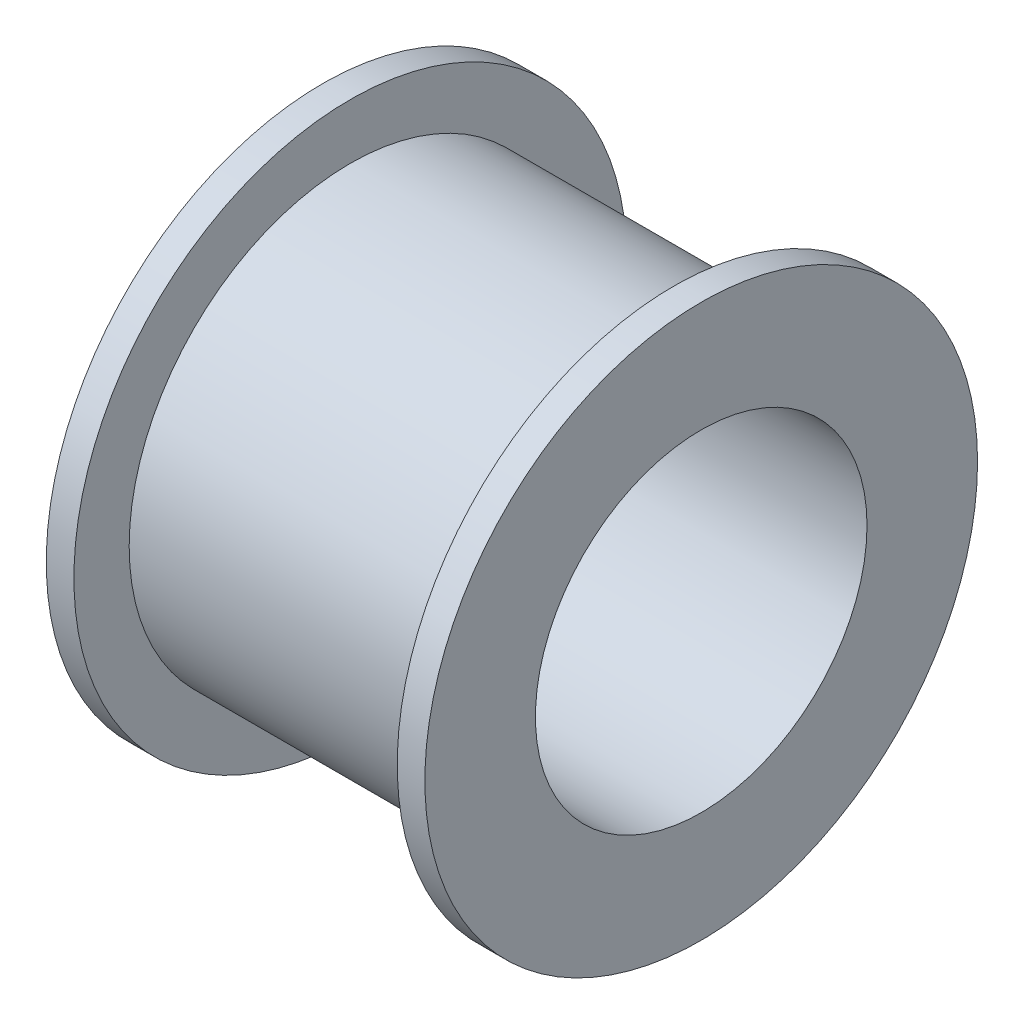
ISO-10303-21;
HEADER;
FILE_DESCRIPTION(('STEP AP214'),'2;1');
FILE_NAME('part.step','',(''),(''),'','','');
FILE_SCHEMA(('AUTOMOTIVE_DESIGN { 1 0 10303 214 1 1 1 1 }'));
ENDSEC;
DATA;
#1=APPLICATION_CONTEXT('core data for automotive mechanical design processes');
#2=APPLICATION_PROTOCOL_DEFINITION('international standard','automotive_design',2000,#1);
#3=PRODUCT_CONTEXT('',#1,'mechanical');
#4=PRODUCT('Part','Part','',(#3));
#5=PRODUCT_RELATED_PRODUCT_CATEGORY('part','',(#4));
#6=PRODUCT_DEFINITION_FORMATION('','',#4);
#7=PRODUCT_DEFINITION_CONTEXT('part definition',#1,'design');
#8=PRODUCT_DEFINITION('design','',#6,#7);
#9=PRODUCT_DEFINITION_SHAPE('','',#8);
#10=(LENGTH_UNIT() NAMED_UNIT(*) SI_UNIT(.MILLI.,.METRE.));
#11=(NAMED_UNIT(*) PLANE_ANGLE_UNIT() SI_UNIT($,.RADIAN.));
#12=(NAMED_UNIT(*) SI_UNIT($,.STERADIAN.) SOLID_ANGLE_UNIT());
#13=UNCERTAINTY_MEASURE_WITH_UNIT(LENGTH_MEASURE(1.E-05),#10,'distance_accuracy_value','');
#14=(GEOMETRIC_REPRESENTATION_CONTEXT(3) GLOBAL_UNCERTAINTY_ASSIGNED_CONTEXT((#13)) GLOBAL_UNIT_ASSIGNED_CONTEXT((#10,
#11,#12)) REPRESENTATION_CONTEXT('',''));
#15=CARTESIAN_POINT('',(0.,0.,0.));
#16=DIRECTION('',(0.,0.,1.));
#17=DIRECTION('',(1.,0.,0.));
#18=AXIS2_PLACEMENT_3D('',#15,#16,#17);
#19=CARTESIAN_POINT('',(71.925,0.,0.));
#20=DIRECTION('',(1.,0.,0.));
#21=DIRECTION('',(0.,0.,-1.));
#22=AXIS2_PLACEMENT_3D('',#19,#20,#21);
#23=CYLINDRICAL_SURFACE('',#22,100.);
#24=CARTESIAN_POINT('',(0.,0.,0.));
#25=DIRECTION('',(1.,0.,0.));
#26=DIRECTION('',(0.,0.,-1.));
#27=AXIS2_PLACEMENT_3D('',#24,#25,#26);
#28=CIRCLE('',#27,100.);
#29=CARTESIAN_POINT('',(0.,0.,-100.));
#30=VERTEX_POINT('',#29);
#31=EDGE_CURVE('E45',#30,#30,#28,.T.);
#32=ORIENTED_EDGE('',*,*,#31,.T.);
#33=EDGE_LOOP('',(#32));
#34=FACE_BOUND('',#33,.T.);
#35=CARTESIAN_POINT('',(9.99999999999999,0.,0.));
#36=DIRECTION('',(1.,0.,0.));
#37=DIRECTION('',(0.,0.,-1.));
#38=AXIS2_PLACEMENT_3D('',#35,#36,#37);
#39=CIRCLE('',#38,100.);
#40=CARTESIAN_POINT('',(9.99999999999999,0.,-100.));
#41=VERTEX_POINT('',#40);
#42=EDGE_CURVE('E10',#41,#41,#39,.T.);
#43=ORIENTED_EDGE('',*,*,#42,.F.);
#44=EDGE_LOOP('',(#43));
#45=FACE_BOUND('',#44,.T.);
#46=ADVANCED_FACE('F31',(#34,#45),#23,.T.);
#47=CARTESIAN_POINT('',(10.,100.,0.));
#48=DIRECTION('',(1.,0.,0.));
#49=DIRECTION('',(0.,0.,-1.));
#50=AXIS2_PLACEMENT_3D('',#47,#48,#49);
#51=PLANE('',#50);
#52=ORIENTED_EDGE('',*,*,#42,.T.);
#53=EDGE_LOOP('',(#52));
#54=FACE_BOUND('',#53,.T.);
#55=CARTESIAN_POINT('',(10.,0.,0.));
#56=DIRECTION('',(1.,0.,0.));
#57=DIRECTION('',(0.,0.,-1.));
#58=AXIS2_PLACEMENT_3D('',#55,#56,#57);
#59=CIRCLE('',#58,80.);
#60=CARTESIAN_POINT('',(10.,0.,-80.));
#61=VERTEX_POINT('',#60);
#62=EDGE_CURVE('E37',#61,#61,#59,.T.);
#63=ORIENTED_EDGE('',*,*,#62,.F.);
#64=EDGE_LOOP('',(#63));
#65=FACE_BOUND('',#64,.T.);
#66=ADVANCED_FACE('F81',(#54,#65),#51,.T.);
#67=CARTESIAN_POINT('',(71.925,0.,0.));
#68=DIRECTION('',(1.,0.,0.));
#69=DIRECTION('',(0.,0.,-1.));
#70=AXIS2_PLACEMENT_3D('',#67,#68,#69);
#71=CYLINDRICAL_SURFACE('',#70,80.);
#72=ORIENTED_EDGE('',*,*,#62,.T.);
#73=EDGE_LOOP('',(#72));
#74=FACE_BOUND('',#73,.T.);
#75=CARTESIAN_POINT('',(127.,0.,0.));
#76=DIRECTION('',(1.,0.,0.));
#77=DIRECTION('',(0.,0.,-1.));
#78=AXIS2_PLACEMENT_3D('',#75,#76,#77);
#79=CIRCLE('',#78,80.);
#80=CARTESIAN_POINT('',(127.,0.,-80.));
#81=VERTEX_POINT('',#80);
#82=EDGE_CURVE('E53',#81,#81,#79,.T.);
#83=ORIENTED_EDGE('',*,*,#82,.F.);
#84=EDGE_LOOP('',(#83));
#85=FACE_BOUND('',#84,.T.);
#86=ADVANCED_FACE('F78',(#74,#85),#71,.T.);
#87=CARTESIAN_POINT('',(71.925,0.,0.));
#88=DIRECTION('',(1.,0.,0.));
#89=DIRECTION('',(0.,0.,-1.));
#90=AXIS2_PLACEMENT_3D('',#87,#88,#89);
#91=CYLINDRICAL_SURFACE('',#90,60.);
#92=CARTESIAN_POINT('',(0.,0.,0.));
#93=DIRECTION('',(1.,0.,0.));
#94=DIRECTION('',(0.,0.,-1.));
#95=AXIS2_PLACEMENT_3D('',#92,#93,#94);
#96=CIRCLE('',#95,60.);
#97=CARTESIAN_POINT('',(0.,0.,-60.));
#98=VERTEX_POINT('',#97);
#99=EDGE_CURVE('E41',#98,#98,#96,.T.);
#100=ORIENTED_EDGE('',*,*,#99,.F.);
#101=EDGE_LOOP('',(#100));
#102=FACE_BOUND('',#101,.T.);
#103=CARTESIAN_POINT('',(137.,0.,0.));
#104=DIRECTION('',(1.,0.,0.));
#105=DIRECTION('',(0.,0.,-1.));
#106=AXIS2_PLACEMENT_3D('',#103,#104,#105);
#107=CIRCLE('',#106,60.);
#108=CARTESIAN_POINT('',(137.,0.,-60.));
#109=VERTEX_POINT('',#108);
#110=EDGE_CURVE('E56',#109,#109,#107,.T.);
#111=ORIENTED_EDGE('',*,*,#110,.T.);
#112=EDGE_LOOP('',(#111));
#113=FACE_BOUND('',#112,.T.);
#114=ADVANCED_FACE('F80',(#102,#113),#91,.F.);
#115=CARTESIAN_POINT('',(0.,100.,0.));
#116=DIRECTION('',(-1.,0.,0.));
#117=DIRECTION('',(0.,0.,1.));
#118=AXIS2_PLACEMENT_3D('',#115,#116,#117);
#119=PLANE('',#118);
#120=ORIENTED_EDGE('',*,*,#99,.T.);
#121=EDGE_LOOP('',(#120));
#122=FACE_BOUND('',#121,.T.);
#123=ORIENTED_EDGE('',*,*,#31,.F.);
#124=EDGE_LOOP('',(#123));
#125=FACE_BOUND('',#124,.T.);
#126=ADVANCED_FACE('F69',(#122,#125),#119,.T.);
#127=CARTESIAN_POINT('',(65.075,0.,0.));
#128=DIRECTION('',(-1.,0.,0.));
#129=DIRECTION('',(0.,0.,-1.));
#130=AXIS2_PLACEMENT_3D('',#127,#128,#129);
#131=CYLINDRICAL_SURFACE('',#130,100.);
#132=CARTESIAN_POINT('',(137.,0.,0.));
#133=DIRECTION('',(1.,0.,0.));
#134=DIRECTION('',(0.,0.,-1.));
#135=AXIS2_PLACEMENT_3D('',#132,#133,#134);
#136=CIRCLE('',#135,100.);
#137=CARTESIAN_POINT('',(137.,0.,-100.));
#138=VERTEX_POINT('',#137);
#139=EDGE_CURVE('E59',#138,#138,#136,.T.);
#140=ORIENTED_EDGE('',*,*,#139,.F.);
#141=EDGE_LOOP('',(#140));
#142=FACE_BOUND('',#141,.T.);
#143=CARTESIAN_POINT('',(127.,0.,0.));
#144=DIRECTION('',(1.,0.,0.));
#145=DIRECTION('',(0.,0.,-1.));
#146=AXIS2_PLACEMENT_3D('',#143,#144,#145);
#147=CIRCLE('',#146,100.);
#148=CARTESIAN_POINT('',(127.,0.,-100.));
#149=VERTEX_POINT('',#148);
#150=EDGE_CURVE('E50',#149,#149,#147,.T.);
#151=ORIENTED_EDGE('',*,*,#150,.T.);
#152=EDGE_LOOP('',(#151));
#153=FACE_BOUND('',#152,.T.);
#154=ADVANCED_FACE('F65',(#142,#153),#131,.T.);
#155=CARTESIAN_POINT('',(127.,100.,0.));
#156=DIRECTION('',(-1.,0.,0.));
#157=DIRECTION('',(0.,0.,-1.));
#158=AXIS2_PLACEMENT_3D('',#155,#156,#157);
#159=PLANE('',#158);
#160=ORIENTED_EDGE('',*,*,#150,.F.);
#161=EDGE_LOOP('',(#160));
#162=FACE_BOUND('',#161,.T.);
#163=ORIENTED_EDGE('',*,*,#82,.T.);
#164=EDGE_LOOP('',(#163));
#165=FACE_BOUND('',#164,.T.);
#166=ADVANCED_FACE('F68',(#162,#165),#159,.T.);
#167=CARTESIAN_POINT('',(137.,100.,0.));
#168=DIRECTION('',(1.,0.,0.));
#169=DIRECTION('',(0.,0.,1.));
#170=AXIS2_PLACEMENT_3D('',#167,#168,#169);
#171=PLANE('',#170);
#172=ORIENTED_EDGE('',*,*,#110,.F.);
#173=EDGE_LOOP('',(#172));
#174=FACE_BOUND('',#173,.T.);
#175=ORIENTED_EDGE('',*,*,#139,.T.);
#176=EDGE_LOOP('',(#175));
#177=FACE_BOUND('',#176,.T.);
#178=ADVANCED_FACE('F63',(#174,#177),#171,.T.);
#179=CLOSED_SHELL('',(#46,#66,#86,#114,#126,#154,#166,#178));
#180=MANIFOLD_SOLID_BREP('B2',#179);
#181=ADVANCED_BREP_SHAPE_REPRESENTATION('',(#18,#180),#14);
#182=SHAPE_DEFINITION_REPRESENTATION(#9,#181);
ENDSEC;
END-ISO-10303-21;
